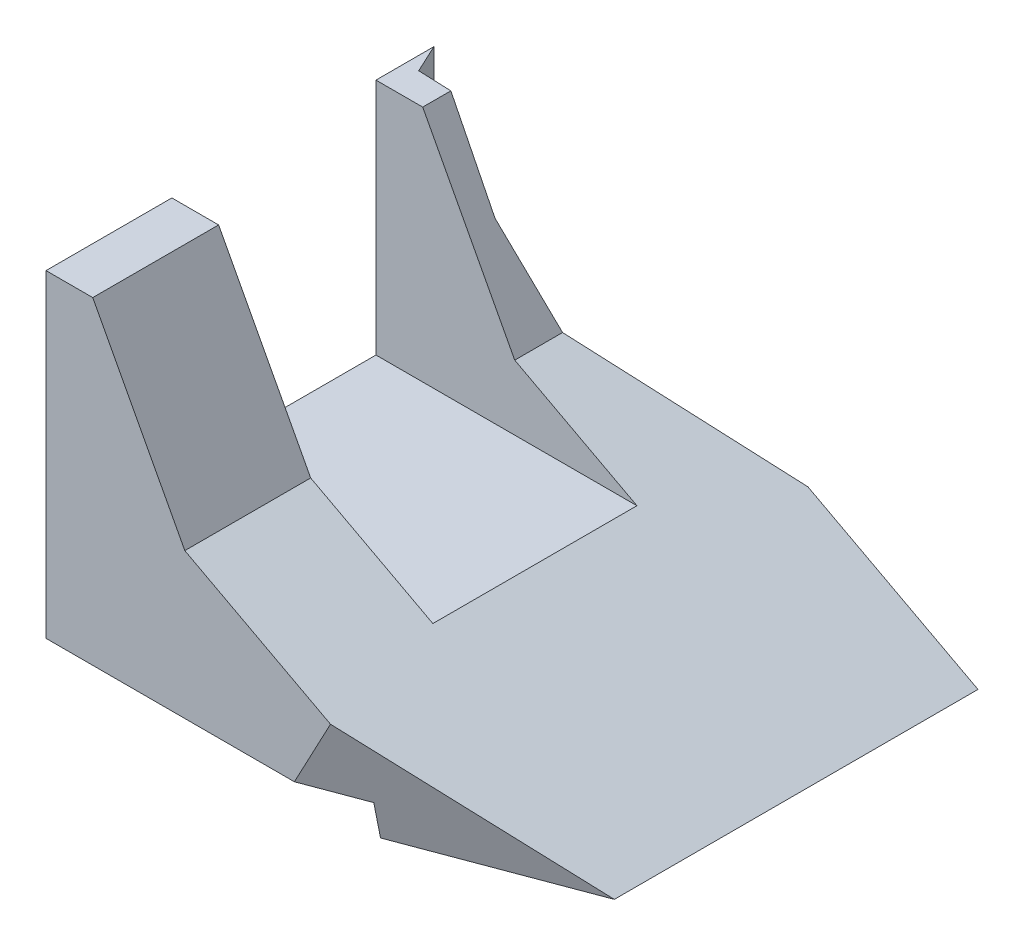
ISO-10303-21;
HEADER;
FILE_DESCRIPTION(('STEP AP214'),'2;1');
FILE_NAME('part.step','',(''),(''),'','','');
FILE_SCHEMA(('AUTOMOTIVE_DESIGN { 1 0 10303 214 1 1 1 1 }'));
ENDSEC;
DATA;
#1=APPLICATION_CONTEXT('core data for automotive mechanical design processes');
#2=APPLICATION_PROTOCOL_DEFINITION('international standard','automotive_design',2000,#1);
#3=PRODUCT_CONTEXT('',#1,'mechanical');
#4=PRODUCT('Part','Part','',(#3));
#5=PRODUCT_RELATED_PRODUCT_CATEGORY('part','',(#4));
#6=PRODUCT_DEFINITION_FORMATION('','',#4);
#7=PRODUCT_DEFINITION_CONTEXT('part definition',#1,'design');
#8=PRODUCT_DEFINITION('design','',#6,#7);
#9=PRODUCT_DEFINITION_SHAPE('','',#8);
#10=(LENGTH_UNIT() NAMED_UNIT(*) SI_UNIT(.MILLI.,.METRE.));
#11=(NAMED_UNIT(*) PLANE_ANGLE_UNIT() SI_UNIT($,.RADIAN.));
#12=(NAMED_UNIT(*) SI_UNIT($,.STERADIAN.) SOLID_ANGLE_UNIT());
#13=UNCERTAINTY_MEASURE_WITH_UNIT(LENGTH_MEASURE(1.E-05),#10,'distance_accuracy_value','');
#14=(GEOMETRIC_REPRESENTATION_CONTEXT(3) GLOBAL_UNCERTAINTY_ASSIGNED_CONTEXT((#13)) GLOBAL_UNIT_ASSIGNED_CONTEXT((#10,
#11,#12)) REPRESENTATION_CONTEXT('',''));
#15=CARTESIAN_POINT('',(0.,0.,0.));
#16=DIRECTION('',(0.,0.,1.));
#17=DIRECTION('',(1.,0.,0.));
#18=AXIS2_PLACEMENT_3D('',#15,#16,#17);
#19=CARTESIAN_POINT('',(70.,51.82,0.));
#20=DIRECTION('',(0.,-1.,0.));
#21=DIRECTION('',(0.,0.,-1.));
#22=AXIS2_PLACEMENT_3D('',#19,#20,#21);
#23=PLANE('',#22);
#24=DIRECTION('',(0.,0.,1.));
#25=VECTOR('',#24,1.);
#26=CARTESIAN_POINT('',(6.87261250913682,51.82,-67.001));
#27=LINE('',#26,#25);
#28=CARTESIAN_POINT('',(6.87261250913682,51.82,-52.637646173006));
#29=VERTEX_POINT('',#28);
#30=CARTESIAN_POINT('',(6.87261250913682,51.82,-48.5));
#31=VERTEX_POINT('',#30);
#32=EDGE_CURVE('E222',#29,#31,#27,.T.);
#33=ORIENTED_EDGE('',*,*,#32,.F.);
#34=DIRECTION('',(0.99921657202049,0.,0.0395757779408101));
#35=VECTOR('',#34,1.);
#36=CARTESIAN_POINT('',(13.6262026525727,51.82,-52.3701580314919));
#37=LINE('',#36,#35);
#38=CARTESIAN_POINT('',(1.95443562586019,51.82,-52.8324394557201));
#39=VERTEX_POINT('',#38);
#40=EDGE_CURVE('E264',#39,#29,#37,.T.);
#41=ORIENTED_EDGE('',*,*,#40,.F.);
#42=DIRECTION('',(0.422618261740693,0.,0.906307787036653));
#43=VECTOR('',#42,1.);
#44=CARTESIAN_POINT('',(1.95443562586019,51.82,-52.8324394557201));
#45=LINE('',#44,#43);
#46=CARTESIAN_POINT('',(0.,51.82,-57.0237401810678));
#47=VERTEX_POINT('',#46);
#48=EDGE_CURVE('E307',#47,#39,#45,.T.);
#49=ORIENTED_EDGE('',*,*,#48,.F.);
#50=DIRECTION('',(0.,0.,1.));
#51=VECTOR('',#50,1.);
#52=CARTESIAN_POINT('',(0.,51.82,0.));
#53=LINE('',#52,#51);
#54=CARTESIAN_POINT('',(0.,51.82,-48.5));
#55=VERTEX_POINT('',#54);
#56=EDGE_CURVE('E226',#47,#55,#53,.T.);
#57=ORIENTED_EDGE('',*,*,#56,.T.);
#58=DIRECTION('',(-1.,0.,0.));
#59=VECTOR('',#58,1.);
#60=CARTESIAN_POINT('',(0.,51.82,-48.5));
#61=LINE('',#60,#59);
#62=EDGE_CURVE('E188',#31,#55,#61,.T.);
#63=ORIENTED_EDGE('',*,*,#62,.F.);
#64=EDGE_LOOP('',(#33,#41,#49,#57,#63));
#65=FACE_BOUND('',#64,.T.);
#66=ADVANCED_FACE('F33',(#65),#23,.F.);
#67=CARTESIAN_POINT('',(20.4043709815235,26.3704637183078,-67.001));
#68=DIRECTION('',(-0.882947592858928,-0.469471562785888,0.));
#69=DIRECTION('',(0.469471562785888,-0.882947592858928,0.));
#70=AXIS2_PLACEMENT_3D('',#67,#68,#69);
#71=PLANE('',#70);
#72=DIRECTION('',(0.,0.,1.));
#73=VECTOR('',#72,1.);
#74=CARTESIAN_POINT('',(20.4043709815235,26.3704637183078,-67.001));
#75=LINE('',#74,#73);
#76=CARTESIAN_POINT('',(20.4043709815235,26.3704637183078,-55.5308698315453));
#77=VERTEX_POINT('',#76);
#78=CARTESIAN_POINT('',(20.4043709815235,26.3704637183078,-48.5));
#79=VERTEX_POINT('',#78);
#80=EDGE_CURVE('E218',#77,#79,#75,.T.);
#81=ORIENTED_EDGE('',*,*,#80,.F.);
#82=DIRECTION('',(0.45861066994838,-0.862521224262136,-0.21385366750852));
#83=VECTOR('',#82,1.);
#84=CARTESIAN_POINT('',(37.1337914189756,-5.09300004831441,-63.3319266980238));
#85=LINE('',#84,#83);
#86=CARTESIAN_POINT('',(13.6262026525727,39.118344281138,-52.3701580314919));
#87=VERTEX_POINT('',#86);
#88=EDGE_CURVE('E313',#87,#77,#85,.T.);
#89=ORIENTED_EDGE('',*,*,#88,.F.);
#90=DIRECTION('',(0.469390424665507,-0.882794994248578,0.0185910559675182));
#91=VECTOR('',#90,1.);
#92=CARTESIAN_POINT('',(29.8363011732732,8.6315829873848,-51.7281277875812));
#93=LINE('',#92,#91);
#94=EDGE_CURVE('E315',#29,#87,#93,.T.);
#95=ORIENTED_EDGE('',*,*,#94,.F.);
#96=ORIENTED_EDGE('',*,*,#32,.T.);
#97=DIRECTION('',(0.469471562785888,-0.882947592858928,0.));
#98=VECTOR('',#97,1.);
#99=CARTESIAN_POINT('',(20.4043709815235,26.3704637183078,-48.5));
#100=LINE('',#99,#98);
#101=EDGE_CURVE('E238',#31,#79,#100,.T.);
#102=ORIENTED_EDGE('',*,*,#101,.T.);
#103=EDGE_LOOP('',(#81,#89,#95,#96,#102));
#104=FACE_BOUND('',#103,.T.);
#105=ADVANCED_FACE('F387',(#104),#71,.F.);
#106=CARTESIAN_POINT('',(70.,0.,0.));
#107=DIRECTION('',(0.,0.,-1.));
#108=DIRECTION('',(-1.,0.,0.));
#109=AXIS2_PLACEMENT_3D('',#106,#107,#108);
#110=PLANE('',#109);
#111=DIRECTION('',(-1.,0.,0.));
#112=VECTOR('',#111,1.);
#113=CARTESIAN_POINT('',(0.,5.,0.));
#114=LINE('',#113,#112);
#115=CARTESIAN_POINT('',(36.5117167531787,5.,0.));
#116=VERTEX_POINT('',#115);
#117=CARTESIAN_POINT('',(0.,5.,0.));
#118=VERTEX_POINT('',#117);
#119=EDGE_CURVE('E177',#116,#118,#114,.T.);
#120=ORIENTED_EDGE('',*,*,#119,.F.);
#121=DIRECTION('',(-0.469471562785892,-0.882947592858926,0.));
#122=VECTOR('',#121,1.);
#123=CARTESIAN_POINT('',(26.3911759738229,-14.0339688873512,0.));
#124=LINE('',#123,#122);
#125=CARTESIAN_POINT('',(41.8200592746814,14.9835402673134,0.));
#126=VERTEX_POINT('',#125);
#127=EDGE_CURVE('E171',#126,#116,#124,.T.);
#128=ORIENTED_EDGE('',*,*,#127,.F.);
#129=DIRECTION('',(0.882947592858926,-0.469471562785892,0.));
#130=VECTOR('',#129,1.);
#131=CARTESIAN_POINT('',(70.,0.,0.));
#132=LINE('',#131,#130);
#133=CARTESIAN_POINT('',(20.4043709815235,26.3704637183078,0.));
#134=VERTEX_POINT('',#133);
#135=EDGE_CURVE('E214',#134,#126,#132,.T.);
#136=ORIENTED_EDGE('',*,*,#135,.F.);
#137=DIRECTION('',(0.469471562785889,-0.882947592858928,0.));
#138=VECTOR('',#137,1.);
#139=CARTESIAN_POINT('',(20.4043709815235,26.3704637183078,0.));
#140=LINE('',#139,#138);
#141=CARTESIAN_POINT('',(6.87261250913682,51.82,0.));
#142=VERTEX_POINT('',#141);
#143=EDGE_CURVE('E211',#142,#134,#140,.T.);
#144=ORIENTED_EDGE('',*,*,#143,.F.);
#145=DIRECTION('',(-1.,0.,0.));
#146=VECTOR('',#145,1.);
#147=CARTESIAN_POINT('',(70.,51.82,0.));
#148=LINE('',#147,#146);
#149=CARTESIAN_POINT('',(0.,51.82,0.));
#150=VERTEX_POINT('',#149);
#151=EDGE_CURVE('E225',#142,#150,#148,.T.);
#152=ORIENTED_EDGE('',*,*,#151,.T.);
#153=DIRECTION('',(0.,-1.,0.));
#154=VECTOR('',#153,1.);
#155=CARTESIAN_POINT('',(0.,0.,0.));
#156=LINE('',#155,#154);
#157=EDGE_CURVE('E220',#150,#118,#156,.T.);
#158=ORIENTED_EDGE('',*,*,#157,.T.);
#159=EDGE_LOOP('',(#120,#128,#136,#144,#152,#158));
#160=FACE_BOUND('',#159,.T.);
#161=ADVANCED_FACE('F35',(#160),#110,.F.);
#162=CARTESIAN_POINT('',(70.,0.,0.));
#163=DIRECTION('',(0.,1.,0.));
#164=DIRECTION('',(0.,0.,1.));
#165=AXIS2_PLACEMENT_3D('',#162,#163,#164);
#166=PLANE('',#165);
#167=DIRECTION('',(0.,0.,-1.));
#168=VECTOR('',#167,1.);
#169=CARTESIAN_POINT('',(70.,0.,0.));
#170=LINE('',#169,#168);
#171=CARTESIAN_POINT('',(70.,0.,-13.5438182504296));
#172=VERTEX_POINT('',#171);
#173=CARTESIAN_POINT('',(70.,0.,-67.));
#174=VERTEX_POINT('',#173);
#175=EDGE_CURVE('E170',#172,#174,#170,.T.);
#176=ORIENTED_EDGE('',*,*,#175,.F.);
#177=DIRECTION('',(0.936424901654556,0.,-0.350868071447454));
#178=VECTOR('',#177,1.);
#179=CARTESIAN_POINT('',(60.9406977981696,0.,-10.149397740467));
#180=LINE('',#179,#178);
#181=CARTESIAN_POINT('',(45.,0.,-4.17659427903824));
#182=VERTEX_POINT('',#181);
#183=EDGE_CURVE('E155',#182,#172,#180,.T.);
#184=ORIENTED_EDGE('',*,*,#183,.F.);
#185=DIRECTION('',(0.,0.,1.));
#186=VECTOR('',#185,1.);
#187=CARTESIAN_POINT('',(45.,0.,-67.001));
#188=LINE('',#187,#186);
#189=CARTESIAN_POINT('',(45.,0.,-67.));
#190=VERTEX_POINT('',#189);
#191=EDGE_CURVE('E168',#190,#182,#188,.T.);
#192=ORIENTED_EDGE('',*,*,#191,.F.);
#193=DIRECTION('',(-1.,0.,0.));
#194=VECTOR('',#193,1.);
#195=CARTESIAN_POINT('',(70.,0.,-67.));
#196=LINE('',#195,#194);
#197=EDGE_CURVE('E233',#174,#190,#196,.T.);
#198=ORIENTED_EDGE('',*,*,#197,.F.);
#199=EDGE_LOOP('',(#176,#184,#192,#198));
#200=FACE_BOUND('',#199,.T.);
#201=ADVANCED_FACE('F166',(#200),#166,.F.);
#202=CARTESIAN_POINT('',(70.,0.,-67.));
#203=DIRECTION('',(0.,0.,1.));
#204=DIRECTION('',(1.,0.,0.));
#205=AXIS2_PLACEMENT_3D('',#202,#203,#204);
#206=PLANE('',#205);
#207=DIRECTION('',(0.,-1.,0.));
#208=VECTOR('',#207,1.);
#209=CARTESIAN_POINT('',(45.,0.,-67.));
#210=LINE('',#209,#208);
#211=CARTESIAN_POINT('',(45.,5.,-67.));
#212=VERTEX_POINT('',#211);
#213=EDGE_CURVE('E175',#212,#190,#210,.T.);
#214=ORIENTED_EDGE('',*,*,#213,.F.);
#215=DIRECTION('',(0.,-1.,0.));
#216=VECTOR('',#215,1.);
#217=CARTESIAN_POINT('',(45.,-0.001000000000001,-67.));
#218=LINE('',#217,#216);
#219=CARTESIAN_POINT('',(45.,13.292735791537,-67.));
#220=VERTEX_POINT('',#219);
#221=EDGE_CURVE('E317',#220,#212,#218,.T.);
#222=ORIENTED_EDGE('',*,*,#221,.F.);
#223=DIRECTION('',(-0.882947592858926,0.469471562785892,0.));
#224=VECTOR('',#223,1.);
#225=CARTESIAN_POINT('',(70.,0.,-67.));
#226=LINE('',#225,#224);
#227=EDGE_CURVE('E208',#174,#220,#226,.T.);
#228=ORIENTED_EDGE('',*,*,#227,.F.);
#229=ORIENTED_EDGE('',*,*,#197,.T.);
#230=EDGE_LOOP('',(#214,#222,#228,#229));
#231=FACE_BOUND('',#230,.T.);
#232=ADVANCED_FACE('F376',(#231),#206,.F.);
#233=CARTESIAN_POINT('',(6.87261250913682,51.82,-18.5));
#234=VERTEX_POINT('',#233);
#235=EDGE_CURVE('E217',#234,#142,#27,.T.);
#236=ORIENTED_EDGE('',*,*,#235,.F.);
#237=DIRECTION('',(1.,0.,0.));
#238=VECTOR('',#237,1.);
#239=CARTESIAN_POINT('',(0.,51.82,-18.5));
#240=LINE('',#239,#238);
#241=CARTESIAN_POINT('',(0.,51.82,-18.5));
#242=VERTEX_POINT('',#241);
#243=EDGE_CURVE('E194',#242,#234,#240,.T.);
#244=ORIENTED_EDGE('',*,*,#243,.F.);
#245=EDGE_CURVE('E229',#242,#150,#53,.T.);
#246=ORIENTED_EDGE('',*,*,#245,.T.);
#247=ORIENTED_EDGE('',*,*,#151,.F.);
#248=EDGE_LOOP('',(#236,#244,#246,#247));
#249=FACE_BOUND('',#248,.T.);
#250=ADVANCED_FACE('F288',(#249),#23,.F.);
#251=CARTESIAN_POINT('',(0.,0.,0.));
#252=DIRECTION('',(-1.,0.,0.));
#253=DIRECTION('',(0.,0.,1.));
#254=AXIS2_PLACEMENT_3D('',#251,#252,#253);
#255=PLANE('',#254);
#256=CARTESIAN_POINT('',(0.,23.3200000000011,-14.7499999999995));
#257=DIRECTION('',(-1.,0.,0.));
#258=DIRECTION('',(0.,0.,1.));
#259=AXIS2_PLACEMENT_3D('',#256,#257,#258);
#260=CIRCLE('',#259,1.58911919519058);
#261=CARTESIAN_POINT('',(0.,23.3200000000011,-13.1608808048089));
#262=VERTEX_POINT('',#261);
#263=EDGE_CURVE('E330',#262,#262,#260,.T.);
#264=ORIENTED_EDGE('',*,*,#263,.F.);
#265=EDGE_LOOP('',(#264));
#266=FACE_BOUND('',#265,.T.);
#267=CARTESIAN_POINT('',(0.,23.3200000000015,-51.7499999999995));
#268=DIRECTION('',(-1.,0.,0.));
#269=DIRECTION('',(0.,0.,1.));
#270=AXIS2_PLACEMENT_3D('',#267,#268,#269);
#271=CIRCLE('',#270,1.62810974372514);
#272=CARTESIAN_POINT('',(0.,23.3200000000015,-50.1218902562743));
#273=VERTEX_POINT('',#272);
#274=EDGE_CURVE('E323',#273,#273,#271,.T.);
#275=ORIENTED_EDGE('',*,*,#274,.F.);
#276=EDGE_LOOP('',(#275));
#277=FACE_BOUND('',#276,.T.);
#278=DIRECTION('',(0.,-1.,0.));
#279=VECTOR('',#278,1.);
#280=CARTESIAN_POINT('',(0.,-0.001000000000001,-57.0237401810678));
#281=LINE('',#280,#279);
#282=CARTESIAN_POINT('',(0.,5.,-57.0237401810678));
#283=VERTEX_POINT('',#282);
#284=EDGE_CURVE('E278',#47,#283,#281,.T.);
#285=ORIENTED_EDGE('',*,*,#284,.T.);
#286=DIRECTION('',(0.,0.,1.));
#287=VECTOR('',#286,1.);
#288=CARTESIAN_POINT('',(0.,5.,-67.001));
#289=LINE('',#288,#287);
#290=EDGE_CURVE('E179',#283,#118,#289,.T.);
#291=ORIENTED_EDGE('',*,*,#290,.T.);
#292=ORIENTED_EDGE('',*,*,#157,.F.);
#293=ORIENTED_EDGE('',*,*,#245,.F.);
#294=DIRECTION('',(0.,1.,0.));
#295=VECTOR('',#294,1.);
#296=CARTESIAN_POINT('',(0.,16.82,-18.5));
#297=LINE('',#296,#295);
#298=CARTESIAN_POINT('',(0.,16.82,-18.5));
#299=VERTEX_POINT('',#298);
#300=EDGE_CURVE('E193',#299,#242,#297,.T.);
#301=ORIENTED_EDGE('',*,*,#300,.F.);
#302=DIRECTION('',(0.,0.,1.));
#303=VECTOR('',#302,1.);
#304=CARTESIAN_POINT('',(0.,16.82,-18.5));
#305=LINE('',#304,#303);
#306=CARTESIAN_POINT('',(0.,16.82,-48.5));
#307=VERTEX_POINT('',#306);
#308=EDGE_CURVE('E184',#307,#299,#305,.T.);
#309=ORIENTED_EDGE('',*,*,#308,.F.);
#310=DIRECTION('',(0.,1.,0.));
#311=VECTOR('',#310,1.);
#312=CARTESIAN_POINT('',(0.,16.82,-48.5));
#313=LINE('',#312,#311);
#314=EDGE_CURVE('E198',#307,#55,#313,.T.);
#315=ORIENTED_EDGE('',*,*,#314,.T.);
#316=ORIENTED_EDGE('',*,*,#56,.F.);
#317=EDGE_LOOP('',(#285,#291,#292,#293,#301,#309,#315,#316));
#318=FACE_BOUND('',#317,.T.);
#319=ADVANCED_FACE('F275',(#266,#277,#318),#255,.T.);
#320=CARTESIAN_POINT('',(70.,0.,-67.001));
#321=DIRECTION('',(-0.469471562785892,-0.882947592858927,0.));
#322=DIRECTION('',(0.882947592858926,-0.469471562785892,0.));
#323=AXIS2_PLACEMENT_3D('',#320,#321,#322);
#324=PLANE('',#323);
#325=ORIENTED_EDGE('',*,*,#135,.T.);
#326=DIRECTION('',(-0.812790669279608,0.432168464822415,0.390642734407085));
#327=VECTOR('',#326,1.);
#328=CARTESIAN_POINT('',(74.3198068340903,-2.29688203664151,-15.62));
#329=LINE('',#328,#327);
#330=EDGE_CURVE('E161',#172,#126,#329,.T.);
#331=ORIENTED_EDGE('',*,*,#330,.F.);
#332=ORIENTED_EDGE('',*,*,#175,.T.);
#333=ORIENTED_EDGE('',*,*,#227,.T.);
#334=DIRECTION('',(0.816453649719839,-0.434116106070477,-0.380718589392953));
#335=VECTOR('',#334,1.);
#336=CARTESIAN_POINT('',(49.711774274424,10.7874409699658,-69.1971364276616));
#337=LINE('',#336,#335);
#338=EDGE_CURVE('E268',#77,#220,#337,.T.);
#339=ORIENTED_EDGE('',*,*,#338,.F.);
#340=ORIENTED_EDGE('',*,*,#80,.T.);
#341=DIRECTION('',(0.882947592858926,-0.469471562785892,0.));
#342=VECTOR('',#341,1.);
#343=CARTESIAN_POINT('',(70.,0.,-48.5));
#344=LINE('',#343,#342);
#345=CARTESIAN_POINT('',(38.3661808528748,16.82,-48.5));
#346=VERTEX_POINT('',#345);
#347=EDGE_CURVE('E205',#79,#346,#344,.T.);
#348=ORIENTED_EDGE('',*,*,#347,.T.);
#349=DIRECTION('',(0.,0.,1.));
#350=VECTOR('',#349,1.);
#351=CARTESIAN_POINT('',(38.3661808528748,16.82,-67.001));
#352=LINE('',#351,#350);
#353=CARTESIAN_POINT('',(38.3661808528748,16.82,-18.5));
#354=VERTEX_POINT('',#353);
#355=EDGE_CURVE('E241',#346,#354,#352,.T.);
#356=ORIENTED_EDGE('',*,*,#355,.T.);
#357=DIRECTION('',(-0.882947592858926,0.469471562785892,0.));
#358=VECTOR('',#357,1.);
#359=CARTESIAN_POINT('',(70.,0.,-18.5));
#360=LINE('',#359,#358);
#361=CARTESIAN_POINT('',(20.4043709815235,26.3704637183078,-18.5));
#362=VERTEX_POINT('',#361);
#363=EDGE_CURVE('E201',#354,#362,#360,.T.);
#364=ORIENTED_EDGE('',*,*,#363,.T.);
#365=EDGE_CURVE('E221',#362,#134,#75,.T.);
#366=ORIENTED_EDGE('',*,*,#365,.T.);
#367=EDGE_LOOP('',(#325,#331,#332,#333,#339,#340,#348,#356,#364,#366));
#368=FACE_BOUND('',#367,.T.);
#369=ADVANCED_FACE('F380',(#368),#324,.F.);
#370=ORIENTED_EDGE('',*,*,#365,.F.);
#371=DIRECTION('',(-0.469471562785888,0.882947592858928,0.));
#372=VECTOR('',#371,1.);
#373=CARTESIAN_POINT('',(20.4043709815235,26.3704637183078,-18.5));
#374=LINE('',#373,#372);
#375=EDGE_CURVE('E235',#362,#234,#374,.T.);
#376=ORIENTED_EDGE('',*,*,#375,.T.);
#377=ORIENTED_EDGE('',*,*,#235,.T.);
#378=ORIENTED_EDGE('',*,*,#143,.T.);
#379=EDGE_LOOP('',(#370,#376,#377,#378));
#380=FACE_BOUND('',#379,.T.);
#381=ADVANCED_FACE('F384',(#380),#71,.F.);
#382=CARTESIAN_POINT('',(0.,16.82,0.));
#383=DIRECTION('',(0.,-1.,0.));
#384=DIRECTION('',(0.,0.,-1.));
#385=AXIS2_PLACEMENT_3D('',#382,#383,#384);
#386=PLANE('',#385);
#387=DIRECTION('',(-1.,0.,0.));
#388=VECTOR('',#387,1.);
#389=CARTESIAN_POINT('',(0.,16.82,-48.5));
#390=LINE('',#389,#388);
#391=EDGE_CURVE('E191',#346,#307,#390,.T.);
#392=ORIENTED_EDGE('',*,*,#391,.T.);
#393=ORIENTED_EDGE('',*,*,#308,.T.);
#394=DIRECTION('',(1.,0.,0.));
#395=VECTOR('',#394,1.);
#396=CARTESIAN_POINT('',(0.,16.82,-18.5));
#397=LINE('',#396,#395);
#398=EDGE_CURVE('E187',#299,#354,#397,.T.);
#399=ORIENTED_EDGE('',*,*,#398,.T.);
#400=ORIENTED_EDGE('',*,*,#355,.F.);
#401=EDGE_LOOP('',(#392,#393,#399,#400));
#402=FACE_BOUND('',#401,.T.);
#403=ADVANCED_FACE('F295',(#402),#386,.F.);
#404=CARTESIAN_POINT('',(0.,16.82,-48.5));
#405=DIRECTION('',(0.,0.,-1.));
#406=DIRECTION('',(-1.,0.,0.));
#407=AXIS2_PLACEMENT_3D('',#404,#405,#406);
#408=PLANE('',#407);
#409=ORIENTED_EDGE('',*,*,#101,.F.);
#410=ORIENTED_EDGE('',*,*,#62,.T.);
#411=ORIENTED_EDGE('',*,*,#314,.F.);
#412=ORIENTED_EDGE('',*,*,#391,.F.);
#413=ORIENTED_EDGE('',*,*,#347,.F.);
#414=EDGE_LOOP('',(#409,#410,#411,#412,#413));
#415=FACE_BOUND('',#414,.T.);
#416=ADVANCED_FACE('F301',(#415),#408,.F.);
#417=CARTESIAN_POINT('',(0.,16.82,-18.5));
#418=DIRECTION('',(0.,0.,1.));
#419=DIRECTION('',(1.,0.,0.));
#420=AXIS2_PLACEMENT_3D('',#417,#418,#419);
#421=PLANE('',#420);
#422=ORIENTED_EDGE('',*,*,#398,.F.);
#423=ORIENTED_EDGE('',*,*,#300,.T.);
#424=ORIENTED_EDGE('',*,*,#243,.T.);
#425=ORIENTED_EDGE('',*,*,#375,.F.);
#426=ORIENTED_EDGE('',*,*,#363,.F.);
#427=EDGE_LOOP('',(#422,#423,#424,#425,#426));
#428=FACE_BOUND('',#427,.T.);
#429=ADVANCED_FACE('F293',(#428),#421,.F.);
#430=CARTESIAN_POINT('',(0.,5.,-67.001));
#431=DIRECTION('',(0.,1.,0.));
#432=DIRECTION('',(0.,0.,1.));
#433=AXIS2_PLACEMENT_3D('',#430,#431,#432);
#434=PLANE('',#433);
#435=CARTESIAN_POINT('',(35.,5.,-54.));
#436=DIRECTION('',(0.,-1.,0.));
#437=DIRECTION('',(0.,0.,-1.));
#438=AXIS2_PLACEMENT_3D('',#435,#436,#437);
#439=CIRCLE('',#438,1.75);
#440=CARTESIAN_POINT('',(35.,5.,-55.75));
#441=VERTEX_POINT('',#440);
#442=EDGE_CURVE('E341',#441,#441,#439,.T.);
#443=ORIENTED_EDGE('',*,*,#442,.F.);
#444=EDGE_LOOP('',(#443));
#445=FACE_BOUND('',#444,.T.);
#446=CARTESIAN_POINT('',(35.,5.,-9.));
#447=DIRECTION('',(0.,-1.,0.));
#448=DIRECTION('',(0.,0.,-1.));
#449=AXIS2_PLACEMENT_3D('',#446,#447,#448);
#450=CIRCLE('',#449,1.75);
#451=CARTESIAN_POINT('',(35.,5.,-10.75));
#452=VERTEX_POINT('',#451);
#453=EDGE_CURVE('E355',#452,#452,#450,.T.);
#454=ORIENTED_EDGE('',*,*,#453,.F.);
#455=EDGE_LOOP('',(#454));
#456=FACE_BOUND('',#455,.T.);
#457=CARTESIAN_POINT('',(9.99999999999999,5.,-47.5137803401736));
#458=DIRECTION('',(0.,-1.,0.));
#459=DIRECTION('',(0.,0.,-1.));
#460=AXIS2_PLACEMENT_3D('',#457,#458,#459);
#461=CIRCLE('',#460,1.75);
#462=CARTESIAN_POINT('',(9.99999999999999,5.,-49.2637803401736));
#463=VERTEX_POINT('',#462);
#464=EDGE_CURVE('E348',#463,#463,#461,.T.);
#465=ORIENTED_EDGE('',*,*,#464,.F.);
#466=EDGE_LOOP('',(#465));
#467=FACE_BOUND('',#466,.T.);
#468=CARTESIAN_POINT('',(35.,5.,-29.));
#469=DIRECTION('',(0.,-1.,0.));
#470=DIRECTION('',(0.,0.,-1.));
#471=AXIS2_PLACEMENT_3D('',#468,#469,#470);
#472=CIRCLE('',#471,1.75);
#473=CARTESIAN_POINT('',(35.,5.,-30.75));
#474=VERTEX_POINT('',#473);
#475=EDGE_CURVE('E365',#474,#474,#472,.T.);
#476=ORIENTED_EDGE('',*,*,#475,.F.);
#477=EDGE_LOOP('',(#476));
#478=FACE_BOUND('',#477,.T.);
#479=CARTESIAN_POINT('',(10.,5.,-29.));
#480=DIRECTION('',(0.,-1.,0.));
#481=DIRECTION('',(0.,0.,-1.));
#482=AXIS2_PLACEMENT_3D('',#479,#480,#481);
#483=CIRCLE('',#482,1.75);
#484=CARTESIAN_POINT('',(10.,5.,-30.75));
#485=VERTEX_POINT('',#484);
#486=EDGE_CURVE('E347',#485,#485,#483,.T.);
#487=ORIENTED_EDGE('',*,*,#486,.F.);
#488=EDGE_LOOP('',(#487));
#489=FACE_BOUND('',#488,.T.);
#490=CARTESIAN_POINT('',(9.99999999999999,5.,-9.));
#491=DIRECTION('',(0.,-1.,0.));
#492=DIRECTION('',(0.,0.,-1.));
#493=AXIS2_PLACEMENT_3D('',#490,#491,#492);
#494=CIRCLE('',#493,1.75);
#495=CARTESIAN_POINT('',(9.99999999999999,5.,-10.75));
#496=VERTEX_POINT('',#495);
#497=EDGE_CURVE('E335',#496,#496,#494,.T.);
#498=ORIENTED_EDGE('',*,*,#497,.F.);
#499=EDGE_LOOP('',(#498));
#500=FACE_BOUND('',#499,.T.);
#501=DIRECTION('',(0.,0.,1.));
#502=VECTOR('',#501,1.);
#503=CARTESIAN_POINT('',(45.,5.,-67.001));
#504=LINE('',#503,#502);
#505=CARTESIAN_POINT('',(45.,5.,-3.18046601222338));
#506=VERTEX_POINT('',#505);
#507=EDGE_CURVE('E176',#212,#506,#504,.T.);
#508=ORIENTED_EDGE('',*,*,#507,.T.);
#509=DIRECTION('',(0.936424901654556,0.,-0.350868071447454));
#510=VECTOR('',#509,1.);
#511=CARTESIAN_POINT('',(61.2679872946211,5.,-9.27590123432198));
#512=LINE('',#511,#510);
#513=EDGE_CURVE('E48',#116,#506,#512,.T.);
#514=ORIENTED_EDGE('',*,*,#513,.F.);
#515=ORIENTED_EDGE('',*,*,#119,.T.);
#516=ORIENTED_EDGE('',*,*,#290,.F.);
#517=DIRECTION('',(-0.422618261740693,0.,-0.906307787036653));
#518=VECTOR('',#517,1.);
#519=CARTESIAN_POINT('',(1.95443562586019,5.,-52.8324394557201));
#520=LINE('',#519,#518);
#521=CARTESIAN_POINT('',(1.95443562586019,5.,-52.8324394557201));
#522=VERTEX_POINT('',#521);
#523=EDGE_CURVE('E262',#522,#283,#520,.T.);
#524=ORIENTED_EDGE('',*,*,#523,.F.);
#525=DIRECTION('',(-0.99921657202049,0.,-0.0395757779408101));
#526=VECTOR('',#525,1.);
#527=CARTESIAN_POINT('',(13.6262026525727,5.,-52.3701580314919));
#528=LINE('',#527,#526);
#529=CARTESIAN_POINT('',(13.6262026525727,5.,-52.3701580314919));
#530=VERTEX_POINT('',#529);
#531=EDGE_CURVE('E257',#530,#522,#528,.T.);
#532=ORIENTED_EDGE('',*,*,#531,.F.);
#533=DIRECTION('',(-0.906307787036653,0.,0.422618261740694));
#534=VECTOR('',#533,1.);
#535=CARTESIAN_POINT('',(45.,5.,-67.));
#536=LINE('',#535,#534);
#537=EDGE_CURVE('E308',#212,#530,#536,.T.);
#538=ORIENTED_EDGE('',*,*,#537,.F.);
#539=EDGE_LOOP('',(#508,#514,#515,#516,#524,#532,#538));
#540=FACE_BOUND('',#539,.T.);
#541=ADVANCED_FACE('F372',(#445,#456,#467,#478,#489,#500,#540),#434,.F.);
#542=CARTESIAN_POINT('',(45.,0.,-67.001));
#543=DIRECTION('',(1.,0.,0.));
#544=DIRECTION('',(0.,0.,-1.));
#545=AXIS2_PLACEMENT_3D('',#542,#543,#544);
#546=PLANE('',#545);
#547=ORIENTED_EDGE('',*,*,#191,.T.);
#548=DIRECTION('',(0.,-0.980726446540751,-0.195385867082427));
#549=VECTOR('',#548,1.);
#550=CARTESIAN_POINT('',(45.,-32.3117307598633,-10.6139199509604));
#551=LINE('',#550,#549);
#552=EDGE_CURVE('E152',#506,#182,#551,.T.);
#553=ORIENTED_EDGE('',*,*,#552,.F.);
#554=ORIENTED_EDGE('',*,*,#507,.F.);
#555=ORIENTED_EDGE('',*,*,#213,.T.);
#556=EDGE_LOOP('',(#547,#553,#554,#555));
#557=FACE_BOUND('',#556,.T.);
#558=ADVANCED_FACE('F173',(#557),#546,.F.);
#559=CARTESIAN_POINT('',(45.,-0.001000000000001,-67.));
#560=DIRECTION('',(0.422618261740694,0.,0.906307787036653));
#561=DIRECTION('',(0.906307787036653,0.,-0.422618261740694));
#562=AXIS2_PLACEMENT_3D('',#559,#560,#561);
#563=PLANE('',#562);
#564=ORIENTED_EDGE('',*,*,#88,.T.);
#565=ORIENTED_EDGE('',*,*,#338,.T.);
#566=ORIENTED_EDGE('',*,*,#221,.T.);
#567=ORIENTED_EDGE('',*,*,#537,.T.);
#568=DIRECTION('',(0.,1.,0.));
#569=VECTOR('',#568,1.);
#570=CARTESIAN_POINT('',(13.6262026525727,-0.001000000000001,-52.3701580314919));
#571=LINE('',#570,#569);
#572=EDGE_CURVE('E259',#530,#87,#571,.T.);
#573=ORIENTED_EDGE('',*,*,#572,.T.);
#574=EDGE_LOOP('',(#564,#565,#566,#567,#573));
#575=FACE_BOUND('',#574,.T.);
#576=ADVANCED_FACE('F436',(#575),#563,.F.);
#577=CARTESIAN_POINT('',(13.6262026525727,-0.001000000000001,-52.3701580314919));
#578=DIRECTION('',(-0.0395757779408101,0.,0.99921657202049));
#579=DIRECTION('',(0.99921657202049,0.,0.0395757779408101));
#580=AXIS2_PLACEMENT_3D('',#577,#578,#579);
#581=PLANE('',#580);
#582=DIRECTION('',(0.,1.,0.));
#583=VECTOR('',#582,1.);
#584=CARTESIAN_POINT('',(1.95443562586019,-0.001000000000001,-52.8324394557201));
#585=LINE('',#584,#583);
#586=CARTESIAN_POINT('',(1.95443562586019,22.103831359429,-52.8324394557201));
#587=VERTEX_POINT('',#586);
#588=EDGE_CURVE('E247',#522,#587,#585,.T.);
#589=ORIENTED_EDGE('',*,*,#588,.T.);
#590=CARTESIAN_POINT('',(29.2840675027753,23.3200000000015,-51.7499999999995));
#591=DIRECTION('',(-0.0395757779408101,0.,0.99921657202049));
#592=DIRECTION('',(-0.99921657202049,0.,-0.0395757779408101));
#593=AXIS2_PLACEMENT_3D('',#590,#591,#592);
#594=ELLIPSE('',#593,41.139045861844,1.62810974372514);
#595=CARTESIAN_POINT('',(6.,21.9782569028865,-52.67220756826));
#596=VERTEX_POINT('',#595);
#597=EDGE_CURVE('E56',#587,#596,#594,.T.);
#598=ORIENTED_EDGE('',*,*,#597,.T.);
#599=DIRECTION('',(0.,-1.,0.));
#600=VECTOR('',#599,1.);
#601=CARTESIAN_POINT('',(6.,-0.001000000000001,-52.67220756826));
#602=LINE('',#601,#600);
#603=CARTESIAN_POINT('',(6.,24.6617430971165,-52.67220756826));
#604=VERTEX_POINT('',#603);
#605=EDGE_CURVE('E11',#604,#596,#602,.T.);
#606=ORIENTED_EDGE('',*,*,#605,.F.);
#607=CARTESIAN_POINT('',(1.95443562586019,24.536168640574,-52.8324394557201));
#608=VERTEX_POINT('',#607);
#609=EDGE_CURVE('E320',#604,#608,#594,.T.);
#610=ORIENTED_EDGE('',*,*,#609,.T.);
#611=EDGE_CURVE('E250',#608,#39,#585,.T.);
#612=ORIENTED_EDGE('',*,*,#611,.T.);
#613=ORIENTED_EDGE('',*,*,#40,.T.);
#614=ORIENTED_EDGE('',*,*,#94,.T.);
#615=ORIENTED_EDGE('',*,*,#572,.F.);
#616=ORIENTED_EDGE('',*,*,#531,.T.);
#617=EDGE_LOOP('',(#589,#598,#606,#610,#612,#613,#614,#615,#616));
#618=FACE_BOUND('',#617,.T.);
#619=ADVANCED_FACE('F253',(#618),#581,.F.);
#620=CARTESIAN_POINT('',(1.95443562586019,-0.001000000000001,-52.8324394557201));
#621=DIRECTION('',(-0.906307787036653,0.,0.422618261740693));
#622=DIRECTION('',(0.422618261740693,0.,0.906307787036653));
#623=AXIS2_PLACEMENT_3D('',#620,#621,#622);
#624=PLANE('',#623);
#625=ORIENTED_EDGE('',*,*,#611,.F.);
#626=CARTESIAN_POINT('',(2.45918543355183,23.3200000000015,-51.7499999999995));
#627=DIRECTION('',(-0.906307787036653,0.,0.422618261740693));
#628=DIRECTION('',(-0.422618261740693,0.,-0.906307787036653));
#629=AXIS2_PLACEMENT_3D('',#626,#627,#628);
#630=ELLIPSE('',#629,1.796420340874,1.62810974372514);
#631=EDGE_CURVE('E41',#608,#587,#630,.T.);
#632=ORIENTED_EDGE('',*,*,#631,.T.);
#633=ORIENTED_EDGE('',*,*,#588,.F.);
#634=ORIENTED_EDGE('',*,*,#523,.T.);
#635=ORIENTED_EDGE('',*,*,#284,.F.);
#636=ORIENTED_EDGE('',*,*,#48,.T.);
#637=EDGE_LOOP('',(#625,#632,#633,#634,#635,#636));
#638=FACE_BOUND('',#637,.T.);
#639=ADVANCED_FACE('F246',(#638),#624,.F.);
#640=CARTESIAN_POINT('',(6.,23.3200000000015,-51.7499999999995));
#641=DIRECTION('',(-1.,0.,0.));
#642=DIRECTION('',(0.,0.,1.));
#643=AXIS2_PLACEMENT_3D('',#640,#641,#642);
#644=PLANE('',#643);
#645=ORIENTED_EDGE('',*,*,#605,.T.);
#646=CARTESIAN_POINT('',(6.,23.3200000000015,-51.7499999999995));
#647=DIRECTION('',(-1.,0.,0.));
#648=DIRECTION('',(0.,0.,1.));
#649=AXIS2_PLACEMENT_3D('',#646,#647,#648);
#650=CIRCLE('',#649,1.62810974372514);
#651=EDGE_CURVE('E326',#596,#604,#650,.T.);
#652=ORIENTED_EDGE('',*,*,#651,.T.);
#653=EDGE_LOOP('',(#645,#652));
#654=FACE_BOUND('',#653,.T.);
#655=ADVANCED_FACE('F467',(#654),#644,.T.);
#656=CARTESIAN_POINT('',(6.,23.3200000000015,-51.7499999999995));
#657=DIRECTION('',(-1.,0.,0.));
#658=DIRECTION('',(0.,0.,1.));
#659=AXIS2_PLACEMENT_3D('',#656,#657,#658);
#660=CYLINDRICAL_SURFACE('',#659,1.62810974372514);
#661=ORIENTED_EDGE('',*,*,#274,.T.);
#662=EDGE_LOOP('',(#661));
#663=FACE_BOUND('',#662,.T.);
#664=ORIENTED_EDGE('',*,*,#631,.F.);
#665=ORIENTED_EDGE('',*,*,#609,.F.);
#666=ORIENTED_EDGE('',*,*,#651,.F.);
#667=ORIENTED_EDGE('',*,*,#597,.F.);
#668=EDGE_LOOP('',(#664,#665,#666,#667));
#669=FACE_BOUND('',#668,.T.);
#670=ADVANCED_FACE('F476',(#663,#669),#660,.F.);
#671=CARTESIAN_POINT('',(6.,23.3200000000011,-14.7499999999995));
#672=DIRECTION('',(-1.,0.,0.));
#673=DIRECTION('',(0.,0.,1.));
#674=AXIS2_PLACEMENT_3D('',#671,#672,#673);
#675=CYLINDRICAL_SURFACE('',#674,1.58911919519058);
#676=CARTESIAN_POINT('',(6.,23.3200000000011,-14.7499999999995));
#677=DIRECTION('',(-1.,0.,0.));
#678=DIRECTION('',(0.,0.,1.));
#679=AXIS2_PLACEMENT_3D('',#676,#677,#678);
#680=CIRCLE('',#679,1.58911919519058);
#681=CARTESIAN_POINT('',(6.,23.3200000000011,-13.1608808048089));
#682=VERTEX_POINT('',#681);
#683=EDGE_CURVE('E322',#682,#682,#680,.T.);
#684=ORIENTED_EDGE('',*,*,#683,.F.);
#685=EDGE_LOOP('',(#684));
#686=FACE_BOUND('',#685,.T.);
#687=ORIENTED_EDGE('',*,*,#263,.T.);
#688=EDGE_LOOP('',(#687));
#689=FACE_BOUND('',#688,.T.);
#690=ADVANCED_FACE('F486',(#686,#689),#675,.F.);
#691=CARTESIAN_POINT('',(6.,23.3200000000011,-14.7499999999995));
#692=DIRECTION('',(-1.,0.,0.));
#693=DIRECTION('',(0.,0.,1.));
#694=AXIS2_PLACEMENT_3D('',#691,#692,#693);
#695=PLANE('',#694);
#696=ORIENTED_EDGE('',*,*,#683,.T.);
#697=EDGE_LOOP('',(#696));
#698=FACE_BOUND('',#697,.T.);
#699=ADVANCED_FACE('F496',(#698),#695,.T.);
#700=CARTESIAN_POINT('',(9.99999999999999,12.,-9.));
#701=DIRECTION('',(0.,-1.,0.));
#702=DIRECTION('',(0.,0.,-1.));
#703=AXIS2_PLACEMENT_3D('',#700,#701,#702);
#704=CYLINDRICAL_SURFACE('',#703,1.75);
#705=CARTESIAN_POINT('',(9.99999999999999,12.,-9.));
#706=DIRECTION('',(0.,-1.,0.));
#707=DIRECTION('',(0.,0.,-1.));
#708=AXIS2_PLACEMENT_3D('',#705,#706,#707);
#709=CIRCLE('',#708,1.75);
#710=CARTESIAN_POINT('',(9.99999999999999,12.,-10.75));
#711=VERTEX_POINT('',#710);
#712=EDGE_CURVE('E327',#711,#711,#709,.T.);
#713=ORIENTED_EDGE('',*,*,#712,.F.);
#714=EDGE_LOOP('',(#713));
#715=FACE_BOUND('',#714,.T.);
#716=ORIENTED_EDGE('',*,*,#497,.T.);
#717=EDGE_LOOP('',(#716));
#718=FACE_BOUND('',#717,.T.);
#719=ADVANCED_FACE('F506',(#715,#718),#704,.F.);
#720=CARTESIAN_POINT('',(9.99999999999999,12.,-9.));
#721=DIRECTION('',(0.,-1.,0.));
#722=DIRECTION('',(0.,0.,-1.));
#723=AXIS2_PLACEMENT_3D('',#720,#721,#722);
#724=PLANE('',#723);
#725=ORIENTED_EDGE('',*,*,#712,.T.);
#726=EDGE_LOOP('',(#725));
#727=FACE_BOUND('',#726,.T.);
#728=ADVANCED_FACE('F516',(#727),#724,.T.);
#729=CARTESIAN_POINT('',(10.,12.,-29.));
#730=DIRECTION('',(0.,-1.,0.));
#731=DIRECTION('',(0.,0.,-1.));
#732=AXIS2_PLACEMENT_3D('',#729,#730,#731);
#733=CYLINDRICAL_SURFACE('',#732,1.75);
#734=CARTESIAN_POINT('',(10.,12.,-29.));
#735=DIRECTION('',(0.,-1.,0.));
#736=DIRECTION('',(0.,0.,-1.));
#737=AXIS2_PLACEMENT_3D('',#734,#735,#736);
#738=CIRCLE('',#737,1.75);
#739=CARTESIAN_POINT('',(10.,12.,-30.75));
#740=VERTEX_POINT('',#739);
#741=EDGE_CURVE('E362',#740,#740,#738,.T.);
#742=ORIENTED_EDGE('',*,*,#741,.F.);
#743=EDGE_LOOP('',(#742));
#744=FACE_BOUND('',#743,.T.);
#745=ORIENTED_EDGE('',*,*,#486,.T.);
#746=EDGE_LOOP('',(#745));
#747=FACE_BOUND('',#746,.T.);
#748=ADVANCED_FACE('F526',(#744,#747),#733,.F.);
#749=CARTESIAN_POINT('',(10.,12.,-29.));
#750=DIRECTION('',(0.,-1.,0.));
#751=DIRECTION('',(0.,0.,-1.));
#752=AXIS2_PLACEMENT_3D('',#749,#750,#751);
#753=PLANE('',#752);
#754=ORIENTED_EDGE('',*,*,#741,.T.);
#755=EDGE_LOOP('',(#754));
#756=FACE_BOUND('',#755,.T.);
#757=ADVANCED_FACE('F536',(#756),#753,.T.);
#758=CARTESIAN_POINT('',(35.,12.,-29.));
#759=DIRECTION('',(0.,-1.,0.));
#760=DIRECTION('',(0.,0.,-1.));
#761=AXIS2_PLACEMENT_3D('',#758,#759,#760);
#762=CYLINDRICAL_SURFACE('',#761,1.75);
#763=CARTESIAN_POINT('',(35.,12.,-29.));
#764=DIRECTION('',(0.,-1.,0.));
#765=DIRECTION('',(0.,0.,-1.));
#766=AXIS2_PLACEMENT_3D('',#763,#764,#765);
#767=CIRCLE('',#766,1.75);
#768=CARTESIAN_POINT('',(35.,12.,-30.75));
#769=VERTEX_POINT('',#768);
#770=EDGE_CURVE('E352',#769,#769,#767,.T.);
#771=ORIENTED_EDGE('',*,*,#770,.F.);
#772=EDGE_LOOP('',(#771));
#773=FACE_BOUND('',#772,.T.);
#774=ORIENTED_EDGE('',*,*,#475,.T.);
#775=EDGE_LOOP('',(#774));
#776=FACE_BOUND('',#775,.T.);
#777=ADVANCED_FACE('F546',(#773,#776),#762,.F.);
#778=CARTESIAN_POINT('',(35.,12.,-29.));
#779=DIRECTION('',(0.,-1.,0.));
#780=DIRECTION('',(0.,0.,-1.));
#781=AXIS2_PLACEMENT_3D('',#778,#779,#780);
#782=PLANE('',#781);
#783=ORIENTED_EDGE('',*,*,#770,.T.);
#784=EDGE_LOOP('',(#783));
#785=FACE_BOUND('',#784,.T.);
#786=ADVANCED_FACE('F556',(#785),#782,.T.);
#787=CARTESIAN_POINT('',(9.99999999999999,12.,-47.5137803401736));
#788=DIRECTION('',(0.,-1.,0.));
#789=DIRECTION('',(0.,0.,-1.));
#790=AXIS2_PLACEMENT_3D('',#787,#788,#789);
#791=CYLINDRICAL_SURFACE('',#790,1.75);
#792=CARTESIAN_POINT('',(9.99999999999999,12.,-47.5137803401736));
#793=DIRECTION('',(0.,-1.,0.));
#794=DIRECTION('',(0.,0.,-1.));
#795=AXIS2_PLACEMENT_3D('',#792,#793,#794);
#796=CIRCLE('',#795,1.75);
#797=CARTESIAN_POINT('',(9.99999999999999,12.,-49.2637803401736));
#798=VERTEX_POINT('',#797);
#799=EDGE_CURVE('E351',#798,#798,#796,.T.);
#800=ORIENTED_EDGE('',*,*,#799,.F.);
#801=EDGE_LOOP('',(#800));
#802=FACE_BOUND('',#801,.T.);
#803=ORIENTED_EDGE('',*,*,#464,.T.);
#804=EDGE_LOOP('',(#803));
#805=FACE_BOUND('',#804,.T.);
#806=ADVANCED_FACE('F566',(#802,#805),#791,.F.);
#807=CARTESIAN_POINT('',(9.99999999999999,12.,-47.5137803401736));
#808=DIRECTION('',(0.,-1.,0.));
#809=DIRECTION('',(0.,0.,-1.));
#810=AXIS2_PLACEMENT_3D('',#807,#808,#809);
#811=PLANE('',#810);
#812=ORIENTED_EDGE('',*,*,#799,.T.);
#813=EDGE_LOOP('',(#812));
#814=FACE_BOUND('',#813,.T.);
#815=ADVANCED_FACE('F576',(#814),#811,.T.);
#816=CARTESIAN_POINT('',(35.,12.,-9.));
#817=DIRECTION('',(0.,-1.,0.));
#818=DIRECTION('',(0.,0.,-1.));
#819=AXIS2_PLACEMENT_3D('',#816,#817,#818);
#820=CYLINDRICAL_SURFACE('',#819,1.75);
#821=CARTESIAN_POINT('',(35.,12.,-9.));
#822=DIRECTION('',(0.,-1.,0.));
#823=DIRECTION('',(0.,0.,-1.));
#824=AXIS2_PLACEMENT_3D('',#821,#822,#823);
#825=CIRCLE('',#824,1.75);
#826=CARTESIAN_POINT('',(35.,12.,-10.75));
#827=VERTEX_POINT('',#826);
#828=EDGE_CURVE('E338',#827,#827,#825,.T.);
#829=ORIENTED_EDGE('',*,*,#828,.F.);
#830=EDGE_LOOP('',(#829));
#831=FACE_BOUND('',#830,.T.);
#832=ORIENTED_EDGE('',*,*,#453,.T.);
#833=EDGE_LOOP('',(#832));
#834=FACE_BOUND('',#833,.T.);
#835=ADVANCED_FACE('F586',(#831,#834),#820,.F.);
#836=CARTESIAN_POINT('',(35.,12.,-9.));
#837=DIRECTION('',(0.,-1.,0.));
#838=DIRECTION('',(0.,0.,-1.));
#839=AXIS2_PLACEMENT_3D('',#836,#837,#838);
#840=PLANE('',#839);
#841=ORIENTED_EDGE('',*,*,#828,.T.);
#842=EDGE_LOOP('',(#841));
#843=FACE_BOUND('',#842,.T.);
#844=ADVANCED_FACE('F596',(#843),#840,.T.);
#845=CARTESIAN_POINT('',(35.,12.,-54.));
#846=DIRECTION('',(0.,-1.,0.));
#847=DIRECTION('',(0.,0.,-1.));
#848=AXIS2_PLACEMENT_3D('',#845,#846,#847);
#849=CYLINDRICAL_SURFACE('',#848,1.75);
#850=CARTESIAN_POINT('',(35.,12.,-54.));
#851=DIRECTION('',(0.,-1.,0.));
#852=DIRECTION('',(0.,0.,-1.));
#853=AXIS2_PLACEMENT_3D('',#850,#851,#852);
#854=CIRCLE('',#853,1.75);
#855=CARTESIAN_POINT('',(35.,12.,-55.75));
#856=VERTEX_POINT('',#855);
#857=EDGE_CURVE('E344',#856,#856,#854,.T.);
#858=ORIENTED_EDGE('',*,*,#857,.F.);
#859=EDGE_LOOP('',(#858));
#860=FACE_BOUND('',#859,.T.);
#861=ORIENTED_EDGE('',*,*,#442,.T.);
#862=EDGE_LOOP('',(#861));
#863=FACE_BOUND('',#862,.T.);
#864=ADVANCED_FACE('F606',(#860,#863),#849,.F.);
#865=CARTESIAN_POINT('',(35.,12.,-54.));
#866=DIRECTION('',(0.,-1.,0.));
#867=DIRECTION('',(0.,0.,-1.));
#868=AXIS2_PLACEMENT_3D('',#865,#866,#867);
#869=PLANE('',#868);
#870=ORIENTED_EDGE('',*,*,#857,.T.);
#871=EDGE_LOOP('',(#870));
#872=FACE_BOUND('',#871,.T.);
#873=ADVANCED_FACE('F615',(#872),#869,.T.);
#874=CARTESIAN_POINT('',(58.8909235332318,-31.314391191306,-15.62));
#875=DIRECTION('',(-0.344917062012565,0.183395655013048,-0.920542369505584));
#876=DIRECTION('',(-0.936424901654556,0.,0.350868071447454));
#877=AXIS2_PLACEMENT_3D('',#874,#875,#876);
#878=PLANE('',#877);
#879=ORIENTED_EDGE('',*,*,#127,.T.);
#880=ORIENTED_EDGE('',*,*,#513,.T.);
#881=ORIENTED_EDGE('',*,*,#552,.T.);
#882=ORIENTED_EDGE('',*,*,#183,.T.);
#883=ORIENTED_EDGE('',*,*,#330,.T.);
#884=EDGE_LOOP('',(#879,#880,#881,#882,#883));
#885=FACE_BOUND('',#884,.T.);
#886=ADVANCED_FACE('F154',(#885),#878,.F.);
#887=CLOSED_SHELL('',(#66,#105,#161,#201,#232,#250,#319,#369,#381,#403,#416,#429,#541,#558,#576,
#619,#639,#655,#670,#690,#699,#719,#728,#748,#757,#777,#786,#806,#815,#835,#844,#864,#873,#886));
#888=MANIFOLD_SOLID_BREP('B2',#887);
#889=ADVANCED_BREP_SHAPE_REPRESENTATION('',(#18,#888),#14);
#890=SHAPE_DEFINITION_REPRESENTATION(#9,#889);
ENDSEC;
END-ISO-10303-21;
